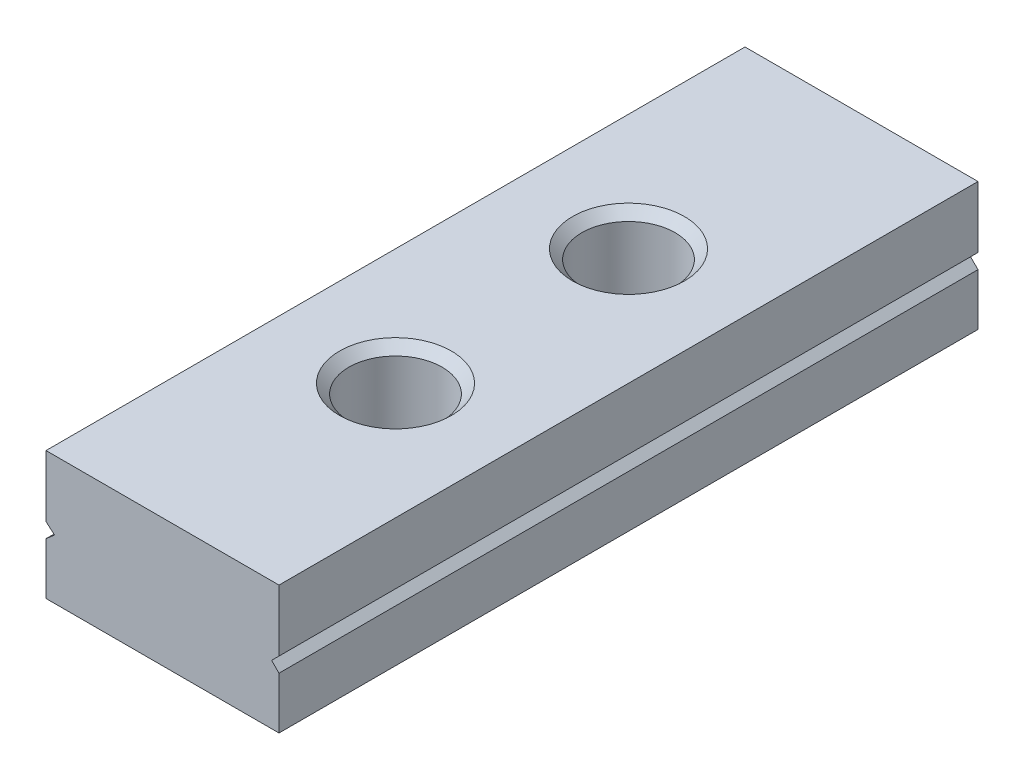
ISO-10303-21;
HEADER;
FILE_DESCRIPTION(('STEP AP214'),'2;1');
FILE_NAME('part.step','',(''),(''),'','','');
FILE_SCHEMA(('AUTOMOTIVE_DESIGN { 1 0 10303 214 1 1 1 1 }'));
ENDSEC;
DATA;
#1=APPLICATION_CONTEXT('core data for automotive mechanical design processes');
#2=APPLICATION_PROTOCOL_DEFINITION('international standard','automotive_design',2000,#1);
#3=PRODUCT_CONTEXT('',#1,'mechanical');
#4=PRODUCT('Part','Part','',(#3));
#5=PRODUCT_RELATED_PRODUCT_CATEGORY('part','',(#4));
#6=PRODUCT_DEFINITION_FORMATION('','',#4);
#7=PRODUCT_DEFINITION_CONTEXT('part definition',#1,'design');
#8=PRODUCT_DEFINITION('design','',#6,#7);
#9=PRODUCT_DEFINITION_SHAPE('','',#8);
#10=(LENGTH_UNIT() NAMED_UNIT(*) SI_UNIT(.MILLI.,.METRE.));
#11=(NAMED_UNIT(*) PLANE_ANGLE_UNIT() SI_UNIT($,.RADIAN.));
#12=(NAMED_UNIT(*) SI_UNIT($,.STERADIAN.) SOLID_ANGLE_UNIT());
#13=UNCERTAINTY_MEASURE_WITH_UNIT(LENGTH_MEASURE(1.E-05),#10,'distance_accuracy_value','');
#14=(GEOMETRIC_REPRESENTATION_CONTEXT(3) GLOBAL_UNCERTAINTY_ASSIGNED_CONTEXT((#13)) GLOBAL_UNIT_ASSIGNED_CONTEXT((#10,
#11,#12)) REPRESENTATION_CONTEXT('',''));
#15=CARTESIAN_POINT('',(0.,0.,0.));
#16=DIRECTION('',(0.,0.,1.));
#17=DIRECTION('',(1.,0.,0.));
#18=AXIS2_PLACEMENT_3D('',#15,#16,#17);
#19=CARTESIAN_POINT('',(0.,2.75,0.));
#20=DIRECTION('',(1.,0.,0.));
#21=DIRECTION('',(0.,0.,-1.));
#22=AXIS2_PLACEMENT_3D('',#19,#20,#21);
#23=PLANE('',#22);
#24=DIRECTION('',(0.,-1.,0.));
#25=VECTOR('',#24,1.);
#26=CARTESIAN_POINT('',(0.,2.75,15.));
#27=LINE('',#26,#25);
#28=CARTESIAN_POINT('',(0.,1.11223709663572,15.));
#29=VERTEX_POINT('',#28);
#30=CARTESIAN_POINT('',(0.,0.,15.));
#31=VERTEX_POINT('',#30);
#32=EDGE_CURVE('E142',#29,#31,#27,.T.);
#33=ORIENTED_EDGE('',*,*,#32,.F.);
#34=DIRECTION('',(0.,0.,-1.));
#35=VECTOR('',#34,1.);
#36=CARTESIAN_POINT('',(0.,1.11223709663572,15.));
#37=LINE('',#36,#35);
#38=CARTESIAN_POINT('',(0.,1.11223709663572,0.));
#39=VERTEX_POINT('',#38);
#40=EDGE_CURVE('E218',#29,#39,#37,.T.);
#41=ORIENTED_EDGE('',*,*,#40,.T.);
#42=DIRECTION('',(0.,-1.,0.));
#43=VECTOR('',#42,1.);
#44=CARTESIAN_POINT('',(0.,2.75,0.));
#45=LINE('',#44,#43);
#46=CARTESIAN_POINT('',(0.,0.,0.));
#47=VERTEX_POINT('',#46);
#48=EDGE_CURVE('E187',#39,#47,#45,.T.);
#49=ORIENTED_EDGE('',*,*,#48,.T.);
#50=DIRECTION('',(0.,0.,1.));
#51=VECTOR('',#50,1.);
#52=CARTESIAN_POINT('',(0.,0.,0.));
#53=LINE('',#52,#51);
#54=EDGE_CURVE('E188',#47,#31,#53,.T.);
#55=ORIENTED_EDGE('',*,*,#54,.T.);
#56=EDGE_LOOP('',(#33,#41,#49,#55));
#57=FACE_BOUND('',#56,.T.);
#58=ADVANCED_FACE('F40',(#57),#23,.F.);
#59=CARTESIAN_POINT('',(5.,2.75,0.));
#60=DIRECTION('',(-1.,0.,0.));
#61=DIRECTION('',(0.,0.,1.));
#62=AXIS2_PLACEMENT_3D('',#59,#60,#61);
#63=PLANE('',#62);
#64=DIRECTION('',(0.,-1.,0.));
#65=VECTOR('',#64,1.);
#66=CARTESIAN_POINT('',(5.,2.75,15.));
#67=LINE('',#66,#65);
#68=CARTESIAN_POINT('',(5.,2.75,15.));
#69=VERTEX_POINT('',#68);
#70=CARTESIAN_POINT('',(5.,1.43019480115344,15.));
#71=VERTEX_POINT('',#70);
#72=EDGE_CURVE('E147',#69,#71,#67,.T.);
#73=ORIENTED_EDGE('',*,*,#72,.T.);
#74=DIRECTION('',(0.,0.,-1.));
#75=VECTOR('',#74,1.);
#76=CARTESIAN_POINT('',(5.,1.43019480115344,15.));
#77=LINE('',#76,#75);
#78=CARTESIAN_POINT('',(5.,1.43019480115344,0.));
#79=VERTEX_POINT('',#78);
#80=EDGE_CURVE('E223',#71,#79,#77,.T.);
#81=ORIENTED_EDGE('',*,*,#80,.T.);
#82=DIRECTION('',(0.,-1.,0.));
#83=VECTOR('',#82,1.);
#84=CARTESIAN_POINT('',(5.,2.75,0.));
#85=LINE('',#84,#83);
#86=CARTESIAN_POINT('',(5.,2.75,0.));
#87=VERTEX_POINT('',#86);
#88=EDGE_CURVE('E198',#87,#79,#85,.T.);
#89=ORIENTED_EDGE('',*,*,#88,.F.);
#90=DIRECTION('',(0.,0.,-1.));
#91=VECTOR('',#90,1.);
#92=CARTESIAN_POINT('',(5.,2.75,0.));
#93=LINE('',#92,#91);
#94=EDGE_CURVE('E176',#69,#87,#93,.T.);
#95=ORIENTED_EDGE('',*,*,#94,.F.);
#96=EDGE_LOOP('',(#73,#81,#89,#95));
#97=FACE_BOUND('',#96,.T.);
#98=ADVANCED_FACE('F258',(#97),#63,.F.);
#99=CARTESIAN_POINT('',(0.,2.75,0.));
#100=VERTEX_POINT('',#99);
#101=CARTESIAN_POINT('',(0.,1.43019480115344,0.));
#102=VERTEX_POINT('',#101);
#103=EDGE_CURVE('E135',#100,#102,#45,.T.);
#104=ORIENTED_EDGE('',*,*,#103,.T.);
#105=DIRECTION('',(0.,0.,-1.));
#106=VECTOR('',#105,1.);
#107=CARTESIAN_POINT('',(0.,1.43019480115344,15.));
#108=LINE('',#107,#106);
#109=CARTESIAN_POINT('',(0.,1.43019480115344,15.));
#110=VERTEX_POINT('',#109);
#111=EDGE_CURVE('E64',#110,#102,#108,.T.);
#112=ORIENTED_EDGE('',*,*,#111,.F.);
#113=CARTESIAN_POINT('',(0.,2.75,15.));
#114=VERTEX_POINT('',#113);
#115=EDGE_CURVE('E133',#114,#110,#27,.T.);
#116=ORIENTED_EDGE('',*,*,#115,.F.);
#117=DIRECTION('',(0.,0.,1.));
#118=VECTOR('',#117,1.);
#119=CARTESIAN_POINT('',(0.,2.75,0.));
#120=LINE('',#119,#118);
#121=EDGE_CURVE('E171',#100,#114,#120,.T.);
#122=ORIENTED_EDGE('',*,*,#121,.F.);
#123=EDGE_LOOP('',(#104,#112,#116,#122));
#124=FACE_BOUND('',#123,.T.);
#125=ADVANCED_FACE('F131',(#124),#23,.F.);
#126=CARTESIAN_POINT('',(0.,2.75,15.));
#127=DIRECTION('',(0.,0.,-1.));
#128=DIRECTION('',(-1.,0.,0.));
#129=AXIS2_PLACEMENT_3D('',#126,#127,#128);
#130=PLANE('',#129);
#131=DIRECTION('',(0.75560741091832,-0.655024763322207,0.));
#132=VECTOR('',#131,1.);
#133=CARTESIAN_POINT('',(0.183390927599167,1.27121594889458,15.));
#134=LINE('',#133,#132);
#135=CARTESIAN_POINT('',(0.183390927599167,1.27121594889458,15.));
#136=VERTEX_POINT('',#135);
#137=EDGE_CURVE('E118',#110,#136,#134,.T.);
#138=ORIENTED_EDGE('',*,*,#137,.T.);
#139=DIRECTION('',(-0.75560741091832,-0.655024763322207,0.));
#140=VECTOR('',#139,1.);
#141=CARTESIAN_POINT('',(0.,1.11223709663572,15.));
#142=LINE('',#141,#140);
#143=EDGE_CURVE('E125',#136,#29,#142,.T.);
#144=ORIENTED_EDGE('',*,*,#143,.T.);
#145=ORIENTED_EDGE('',*,*,#32,.T.);
#146=DIRECTION('',(1.,0.,0.));
#147=VECTOR('',#146,1.);
#148=CARTESIAN_POINT('',(0.,0.,15.));
#149=LINE('',#148,#147);
#150=CARTESIAN_POINT('',(5.,0.,15.));
#151=VERTEX_POINT('',#150);
#152=EDGE_CURVE('E191',#31,#151,#149,.T.);
#153=ORIENTED_EDGE('',*,*,#152,.T.);
#154=CARTESIAN_POINT('',(5.,1.11223709663572,15.));
#155=VERTEX_POINT('',#154);
#156=EDGE_CURVE('E200',#155,#151,#67,.T.);
#157=ORIENTED_EDGE('',*,*,#156,.F.);
#158=DIRECTION('',(-0.707106781186546,0.707106781186549,0.));
#159=VECTOR('',#158,1.);
#160=CARTESIAN_POINT('',(5.,1.11223709663572,15.));
#161=LINE('',#160,#159);
#162=CARTESIAN_POINT('',(4.84102114774114,1.27121594889458,15.));
#163=VERTEX_POINT('',#162);
#164=EDGE_CURVE('E229',#155,#163,#161,.T.);
#165=ORIENTED_EDGE('',*,*,#164,.T.);
#166=DIRECTION('',(0.707106781186549,0.707106781186546,0.));
#167=VECTOR('',#166,1.);
#168=CARTESIAN_POINT('',(4.84102114774114,1.27121594889458,15.));
#169=LINE('',#168,#167);
#170=EDGE_CURVE('E232',#163,#71,#169,.T.);
#171=ORIENTED_EDGE('',*,*,#170,.T.);
#172=ORIENTED_EDGE('',*,*,#72,.F.);
#173=DIRECTION('',(1.,0.,0.));
#174=VECTOR('',#173,1.);
#175=CARTESIAN_POINT('',(0.,2.75,15.));
#176=LINE('',#175,#174);
#177=EDGE_CURVE('E139',#114,#69,#176,.T.);
#178=ORIENTED_EDGE('',*,*,#177,.F.);
#179=ORIENTED_EDGE('',*,*,#115,.T.);
#180=EDGE_LOOP('',(#138,#144,#145,#153,#157,#165,#171,#172,#178,#179));
#181=FACE_BOUND('',#180,.T.);
#182=ADVANCED_FACE('F137',(#181),#130,.F.);
#183=CARTESIAN_POINT('',(5.,1.11223709663572,0.));
#184=VERTEX_POINT('',#183);
#185=CARTESIAN_POINT('',(5.,0.,0.));
#186=VERTEX_POINT('',#185);
#187=EDGE_CURVE('E197',#184,#186,#85,.T.);
#188=ORIENTED_EDGE('',*,*,#187,.F.);
#189=DIRECTION('',(0.,0.,-1.));
#190=VECTOR('',#189,1.);
#191=CARTESIAN_POINT('',(5.,1.11223709663572,15.));
#192=LINE('',#191,#190);
#193=EDGE_CURVE('E56',#155,#184,#192,.T.);
#194=ORIENTED_EDGE('',*,*,#193,.F.);
#195=ORIENTED_EDGE('',*,*,#156,.T.);
#196=DIRECTION('',(0.,0.,-1.));
#197=VECTOR('',#196,1.);
#198=CARTESIAN_POINT('',(5.,0.,0.));
#199=LINE('',#198,#197);
#200=EDGE_CURVE('E179',#151,#186,#199,.T.);
#201=ORIENTED_EDGE('',*,*,#200,.T.);
#202=EDGE_LOOP('',(#188,#194,#195,#201));
#203=FACE_BOUND('',#202,.T.);
#204=ADVANCED_FACE('F211',(#203),#63,.F.);
#205=CARTESIAN_POINT('',(0.,2.75,0.));
#206=DIRECTION('',(0.,0.,1.));
#207=DIRECTION('',(1.,0.,0.));
#208=AXIS2_PLACEMENT_3D('',#205,#206,#207);
#209=PLANE('',#208);
#210=ORIENTED_EDGE('',*,*,#48,.F.);
#211=DIRECTION('',(-0.75560741091832,-0.655024763322207,0.));
#212=VECTOR('',#211,1.);
#213=CARTESIAN_POINT('',(0.,1.11223709663572,0.));
#214=LINE('',#213,#212);
#215=CARTESIAN_POINT('',(0.183390927599167,1.27121594889458,0.));
#216=VERTEX_POINT('',#215);
#217=EDGE_CURVE('E126',#216,#39,#214,.T.);
#218=ORIENTED_EDGE('',*,*,#217,.F.);
#219=DIRECTION('',(0.75560741091832,-0.655024763322207,0.));
#220=VECTOR('',#219,1.);
#221=CARTESIAN_POINT('',(0.183390927599167,1.27121594889458,0.));
#222=LINE('',#221,#220);
#223=EDGE_CURVE('E220',#102,#216,#222,.T.);
#224=ORIENTED_EDGE('',*,*,#223,.F.);
#225=ORIENTED_EDGE('',*,*,#103,.F.);
#226=DIRECTION('',(-1.,0.,0.));
#227=VECTOR('',#226,1.);
#228=CARTESIAN_POINT('',(0.,2.75,0.));
#229=LINE('',#228,#227);
#230=EDGE_CURVE('E173',#87,#100,#229,.T.);
#231=ORIENTED_EDGE('',*,*,#230,.F.);
#232=ORIENTED_EDGE('',*,*,#88,.T.);
#233=DIRECTION('',(0.707106781186549,0.707106781186546,0.));
#234=VECTOR('',#233,1.);
#235=CARTESIAN_POINT('',(4.84102114774114,1.27121594889458,0.));
#236=LINE('',#235,#234);
#237=CARTESIAN_POINT('',(4.84102114774114,1.27121594889458,0.));
#238=VERTEX_POINT('',#237);
#239=EDGE_CURVE('E233',#238,#79,#236,.T.);
#240=ORIENTED_EDGE('',*,*,#239,.F.);
#241=DIRECTION('',(-0.707106781186546,0.707106781186549,0.));
#242=VECTOR('',#241,1.);
#243=CARTESIAN_POINT('',(5.,1.11223709663572,0.));
#244=LINE('',#243,#242);
#245=EDGE_CURVE('E208',#184,#238,#244,.T.);
#246=ORIENTED_EDGE('',*,*,#245,.F.);
#247=ORIENTED_EDGE('',*,*,#187,.T.);
#248=DIRECTION('',(-1.,0.,0.));
#249=VECTOR('',#248,1.);
#250=CARTESIAN_POINT('',(0.,0.,0.));
#251=LINE('',#250,#249);
#252=EDGE_CURVE('E174',#186,#47,#251,.T.);
#253=ORIENTED_EDGE('',*,*,#252,.T.);
#254=EDGE_LOOP('',(#210,#218,#224,#225,#231,#232,#240,#246,#247,#253));
#255=FACE_BOUND('',#254,.T.);
#256=ADVANCED_FACE('F167',(#255),#209,.F.);
#257=CARTESIAN_POINT('',(0.,2.75,0.));
#258=DIRECTION('',(0.,1.,0.));
#259=DIRECTION('',(0.,0.,1.));
#260=AXIS2_PLACEMENT_3D('',#257,#258,#259);
#261=PLANE('',#260);
#262=CARTESIAN_POINT('',(2.5,2.75,5.));
#263=DIRECTION('',(0.,1.,0.));
#264=DIRECTION('',(0.,0.,1.));
#265=AXIS2_PLACEMENT_3D('',#262,#263,#264);
#266=CIRCLE('',#265,1.2);
#267=CARTESIAN_POINT('',(2.5,2.75,6.2));
#268=VERTEX_POINT('',#267);
#269=EDGE_CURVE('E145',#268,#268,#266,.F.);
#270=ORIENTED_EDGE('',*,*,#269,.T.);
#271=EDGE_LOOP('',(#270));
#272=FACE_BOUND('',#271,.T.);
#273=CARTESIAN_POINT('',(2.5,2.75,10.));
#274=DIRECTION('',(0.,1.,0.));
#275=DIRECTION('',(0.,0.,1.));
#276=AXIS2_PLACEMENT_3D('',#273,#274,#275);
#277=CIRCLE('',#276,1.2);
#278=CARTESIAN_POINT('',(2.5,2.75,11.2));
#279=VERTEX_POINT('',#278);
#280=EDGE_CURVE('E141',#279,#279,#277,.F.);
#281=ORIENTED_EDGE('',*,*,#280,.T.);
#282=EDGE_LOOP('',(#281));
#283=FACE_BOUND('',#282,.T.);
#284=ORIENTED_EDGE('',*,*,#121,.T.);
#285=ORIENTED_EDGE('',*,*,#177,.T.);
#286=ORIENTED_EDGE('',*,*,#94,.T.);
#287=ORIENTED_EDGE('',*,*,#230,.T.);
#288=EDGE_LOOP('',(#284,#285,#286,#287));
#289=FACE_BOUND('',#288,.T.);
#290=ADVANCED_FACE('F163',(#272,#283,#289),#261,.T.);
#291=CARTESIAN_POINT('',(0.,0.,0.));
#292=DIRECTION('',(0.,1.,0.));
#293=DIRECTION('',(0.,0.,1.));
#294=AXIS2_PLACEMENT_3D('',#291,#292,#293);
#295=PLANE('',#294);
#296=CARTESIAN_POINT('',(2.5,0.,10.));
#297=DIRECTION('',(0.,-1.,0.));
#298=DIRECTION('',(0.,0.,-1.));
#299=AXIS2_PLACEMENT_3D('',#296,#297,#298);
#300=CIRCLE('',#299,1.);
#301=CARTESIAN_POINT('',(2.5,0.,9.));
#302=VERTEX_POINT('',#301);
#303=EDGE_CURVE('E192',#302,#302,#300,.T.);
#304=ORIENTED_EDGE('',*,*,#303,.F.);
#305=EDGE_LOOP('',(#304));
#306=FACE_BOUND('',#305,.T.);
#307=CARTESIAN_POINT('',(2.5,0.,5.));
#308=DIRECTION('',(0.,-1.,0.));
#309=DIRECTION('',(0.,0.,-1.));
#310=AXIS2_PLACEMENT_3D('',#307,#308,#309);
#311=CIRCLE('',#310,1.);
#312=CARTESIAN_POINT('',(2.5,0.,4.));
#313=VERTEX_POINT('',#312);
#314=EDGE_CURVE('E182',#313,#313,#311,.T.);
#315=ORIENTED_EDGE('',*,*,#314,.F.);
#316=EDGE_LOOP('',(#315));
#317=FACE_BOUND('',#316,.T.);
#318=ORIENTED_EDGE('',*,*,#54,.F.);
#319=ORIENTED_EDGE('',*,*,#252,.F.);
#320=ORIENTED_EDGE('',*,*,#200,.F.);
#321=ORIENTED_EDGE('',*,*,#152,.F.);
#322=EDGE_LOOP('',(#318,#319,#320,#321));
#323=FACE_BOUND('',#322,.T.);
#324=ADVANCED_FACE('F166',(#306,#317,#323),#295,.F.);
#325=CARTESIAN_POINT('',(2.5,2.75,5.));
#326=DIRECTION('',(0.,-1.,0.));
#327=DIRECTION('',(0.,0.,-1.));
#328=AXIS2_PLACEMENT_3D('',#325,#326,#327);
#329=CYLINDRICAL_SURFACE('',#328,1.);
#330=CARTESIAN_POINT('',(2.5,2.55,5.));
#331=DIRECTION('',(0.,1.,0.));
#332=DIRECTION('',(0.,0.,1.));
#333=AXIS2_PLACEMENT_3D('',#330,#331,#332);
#334=CIRCLE('',#333,1.);
#335=CARTESIAN_POINT('',(2.5,2.55,6.));
#336=VERTEX_POINT('',#335);
#337=EDGE_CURVE('E49',#336,#336,#334,.T.);
#338=ORIENTED_EDGE('',*,*,#337,.T.);
#339=EDGE_LOOP('',(#338));
#340=FACE_BOUND('',#339,.T.);
#341=ORIENTED_EDGE('',*,*,#314,.T.);
#342=EDGE_LOOP('',(#341));
#343=FACE_BOUND('',#342,.T.);
#344=ADVANCED_FACE('F155',(#340,#343),#329,.F.);
#345=CARTESIAN_POINT('',(2.5,2.75,10.));
#346=DIRECTION('',(0.,-1.,0.));
#347=DIRECTION('',(0.,0.,-1.));
#348=AXIS2_PLACEMENT_3D('',#345,#346,#347);
#349=CYLINDRICAL_SURFACE('',#348,1.);
#350=CARTESIAN_POINT('',(2.5,2.55,10.));
#351=DIRECTION('',(0.,1.,0.));
#352=DIRECTION('',(0.,0.,1.));
#353=AXIS2_PLACEMENT_3D('',#350,#351,#352);
#354=CIRCLE('',#353,1.);
#355=CARTESIAN_POINT('',(2.5,2.55,11.));
#356=VERTEX_POINT('',#355);
#357=EDGE_CURVE('E11',#356,#356,#354,.T.);
#358=ORIENTED_EDGE('',*,*,#357,.T.);
#359=EDGE_LOOP('',(#358));
#360=FACE_BOUND('',#359,.T.);
#361=ORIENTED_EDGE('',*,*,#303,.T.);
#362=EDGE_LOOP('',(#361));
#363=FACE_BOUND('',#362,.T.);
#364=ADVANCED_FACE('F254',(#360,#363),#349,.F.);
#365=CARTESIAN_POINT('',(4.84102114774114,1.27121594889458,15.));
#366=DIRECTION('',(-0.707106781186546,0.707106781186549,0.));
#367=DIRECTION('',(-0.707106781186549,-0.707106781186546,0.));
#368=AXIS2_PLACEMENT_3D('',#365,#366,#367);
#369=PLANE('',#368);
#370=ORIENTED_EDGE('',*,*,#239,.T.);
#371=ORIENTED_EDGE('',*,*,#80,.F.);
#372=ORIENTED_EDGE('',*,*,#170,.F.);
#373=DIRECTION('',(0.,0.,-1.));
#374=VECTOR('',#373,1.);
#375=CARTESIAN_POINT('',(4.84102114774114,1.27121594889458,15.));
#376=LINE('',#375,#374);
#377=EDGE_CURVE('E240',#163,#238,#376,.T.);
#378=ORIENTED_EDGE('',*,*,#377,.T.);
#379=EDGE_LOOP('',(#370,#371,#372,#378));
#380=FACE_BOUND('',#379,.T.);
#381=ADVANCED_FACE('F304',(#380),#369,.F.);
#382=CARTESIAN_POINT('',(5.,1.11223709663572,15.));
#383=DIRECTION('',(-0.707106781186549,-0.707106781186546,0.));
#384=DIRECTION('',(0.707106781186546,-0.707106781186549,0.));
#385=AXIS2_PLACEMENT_3D('',#382,#383,#384);
#386=PLANE('',#385);
#387=ORIENTED_EDGE('',*,*,#245,.T.);
#388=ORIENTED_EDGE('',*,*,#377,.F.);
#389=ORIENTED_EDGE('',*,*,#164,.F.);
#390=ORIENTED_EDGE('',*,*,#193,.T.);
#391=EDGE_LOOP('',(#387,#388,#389,#390));
#392=FACE_BOUND('',#391,.T.);
#393=ADVANCED_FACE('F333',(#392),#386,.F.);
#394=CARTESIAN_POINT('',(0.,1.11223709663572,15.));
#395=DIRECTION('',(0.655024763322207,-0.75560741091832,0.));
#396=DIRECTION('',(0.75560741091832,0.655024763322207,0.));
#397=AXIS2_PLACEMENT_3D('',#394,#395,#396);
#398=PLANE('',#397);
#399=ORIENTED_EDGE('',*,*,#217,.T.);
#400=ORIENTED_EDGE('',*,*,#40,.F.);
#401=ORIENTED_EDGE('',*,*,#143,.F.);
#402=DIRECTION('',(0.,0.,-1.));
#403=VECTOR('',#402,1.);
#404=CARTESIAN_POINT('',(0.183390927599167,1.27121594889458,15.));
#405=LINE('',#404,#403);
#406=EDGE_CURVE('E120',#136,#216,#405,.T.);
#407=ORIENTED_EDGE('',*,*,#406,.T.);
#408=EDGE_LOOP('',(#399,#400,#401,#407));
#409=FACE_BOUND('',#408,.T.);
#410=ADVANCED_FACE('F329',(#409),#398,.F.);
#411=CARTESIAN_POINT('',(0.183390927599167,1.27121594889458,15.));
#412=DIRECTION('',(0.655024763322207,0.75560741091832,0.));
#413=DIRECTION('',(-0.75560741091832,0.655024763322207,0.));
#414=AXIS2_PLACEMENT_3D('',#411,#412,#413);
#415=PLANE('',#414);
#416=ORIENTED_EDGE('',*,*,#223,.T.);
#417=ORIENTED_EDGE('',*,*,#406,.F.);
#418=ORIENTED_EDGE('',*,*,#137,.F.);
#419=ORIENTED_EDGE('',*,*,#111,.T.);
#420=EDGE_LOOP('',(#416,#417,#418,#419));
#421=FACE_BOUND('',#420,.T.);
#422=ADVANCED_FACE('F119',(#421),#415,.F.);
#423=CARTESIAN_POINT('',(2.5,2.75,5.));
#424=DIRECTION('',(0.,1.,0.));
#425=DIRECTION('',(0.,0.,1.));
#426=AXIS2_PLACEMENT_3D('',#423,#424,#425);
#427=CONICAL_SURFACE('',#426,1.2,0.785398163397445);
#428=ORIENTED_EDGE('',*,*,#337,.F.);
#429=EDGE_LOOP('',(#428));
#430=FACE_BOUND('',#429,.T.);
#431=ORIENTED_EDGE('',*,*,#269,.F.);
#432=EDGE_LOOP('',(#431));
#433=FACE_BOUND('',#432,.T.);
#434=ADVANCED_FACE('F158',(#430,#433),#427,.F.);
#435=CARTESIAN_POINT('',(2.5,2.75,10.));
#436=DIRECTION('',(0.,1.,0.));
#437=DIRECTION('',(0.,0.,1.));
#438=AXIS2_PLACEMENT_3D('',#435,#436,#437);
#439=CONICAL_SURFACE('',#438,1.2,0.785398163397448);
#440=ORIENTED_EDGE('',*,*,#357,.F.);
#441=EDGE_LOOP('',(#440));
#442=FACE_BOUND('',#441,.T.);
#443=ORIENTED_EDGE('',*,*,#280,.F.);
#444=EDGE_LOOP('',(#443));
#445=FACE_BOUND('',#444,.T.);
#446=ADVANCED_FACE('F43',(#442,#445),#439,.F.);
#447=CLOSED_SHELL('',(#58,#98,#125,#182,#204,#256,#290,#324,#344,#364,#381,#393,#410,#422,#434,#446));
#448=MANIFOLD_SOLID_BREP('B2',#447);
#449=ADVANCED_BREP_SHAPE_REPRESENTATION('',(#18,#448),#14);
#450=SHAPE_DEFINITION_REPRESENTATION(#9,#449);
ENDSEC;
END-ISO-10303-21;
